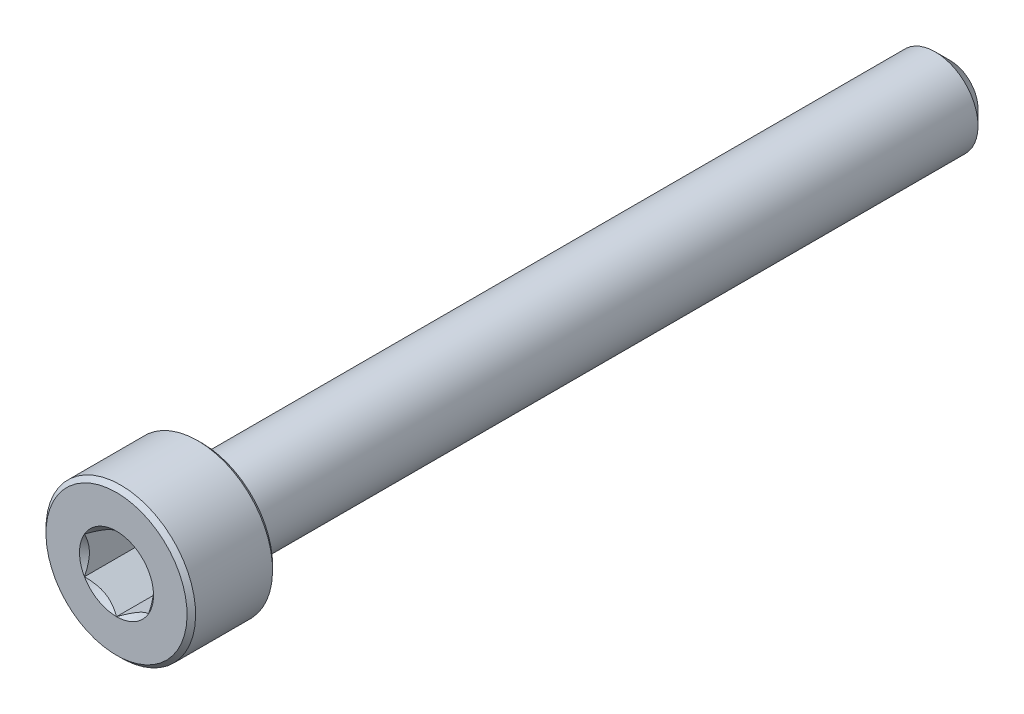
ISO-10303-21;
HEADER;
FILE_DESCRIPTION(('STEP AP214'),'2;1');
FILE_NAME('part.step','',(''),(''),'','','');
FILE_SCHEMA(('AUTOMOTIVE_DESIGN { 1 0 10303 214 1 1 1 1 }'));
ENDSEC;
DATA;
#1=APPLICATION_CONTEXT('core data for automotive mechanical design processes');
#2=APPLICATION_PROTOCOL_DEFINITION('international standard','automotive_design',2000,#1);
#3=PRODUCT_CONTEXT('',#1,'mechanical');
#4=PRODUCT('Part','Part','',(#3));
#5=PRODUCT_RELATED_PRODUCT_CATEGORY('part','',(#4));
#6=PRODUCT_DEFINITION_FORMATION('','',#4);
#7=PRODUCT_DEFINITION_CONTEXT('part definition',#1,'design');
#8=PRODUCT_DEFINITION('design','',#6,#7);
#9=PRODUCT_DEFINITION_SHAPE('','',#8);
#10=(LENGTH_UNIT() NAMED_UNIT(*) SI_UNIT(.MILLI.,.METRE.));
#11=(NAMED_UNIT(*) PLANE_ANGLE_UNIT() SI_UNIT($,.RADIAN.));
#12=(NAMED_UNIT(*) SI_UNIT($,.STERADIAN.) SOLID_ANGLE_UNIT());
#13=UNCERTAINTY_MEASURE_WITH_UNIT(LENGTH_MEASURE(1.E-05),#10,'distance_accuracy_value','');
#14=(GEOMETRIC_REPRESENTATION_CONTEXT(3) GLOBAL_UNCERTAINTY_ASSIGNED_CONTEXT((#13)) GLOBAL_UNIT_ASSIGNED_CONTEXT((#10,
#11,#12)) REPRESENTATION_CONTEXT('',''));
#15=CARTESIAN_POINT('',(0.,0.,0.));
#16=DIRECTION('',(0.,0.,1.));
#17=DIRECTION('',(1.,0.,0.));
#18=AXIS2_PLACEMENT_3D('',#15,#16,#17);
#19=CARTESIAN_POINT('',(0.,0.,19.5));
#20=DIRECTION('',(0.,0.,1.));
#21=DIRECTION('',(0.,-1.,0.));
#22=AXIS2_PLACEMENT_3D('',#19,#20,#21);
#23=PLANE('',#22);
#24=CARTESIAN_POINT('',(0.,0.,19.5));
#25=DIRECTION('',(0.,0.,1.));
#26=DIRECTION('',(1.,0.,0.));
#27=AXIS2_PLACEMENT_3D('',#24,#25,#26);
#28=CIRCLE('',#27,1.73205080756888);
#29=CARTESIAN_POINT('',(0.,-1.73205080756888,19.5));
#30=VERTEX_POINT('',#29);
#31=CARTESIAN_POINT('',(1.5,-0.866025403784438,19.5));
#32=VERTEX_POINT('',#31);
#33=EDGE_CURVE('E99',#30,#32,#28,.T.);
#34=ORIENTED_EDGE('',*,*,#33,.F.);
#35=CARTESIAN_POINT('',(-1.5,-0.866025403784439,19.5));
#36=VERTEX_POINT('',#35);
#37=EDGE_CURVE('E269',#36,#30,#28,.T.);
#38=ORIENTED_EDGE('',*,*,#37,.F.);
#39=CARTESIAN_POINT('',(-1.5,0.86602540378444,19.5));
#40=VERTEX_POINT('',#39);
#41=EDGE_CURVE('E134',#40,#36,#28,.T.);
#42=ORIENTED_EDGE('',*,*,#41,.F.);
#43=CARTESIAN_POINT('',(0.,1.73205080756888,19.5));
#44=VERTEX_POINT('',#43);
#45=EDGE_CURVE('E130',#44,#40,#28,.T.);
#46=ORIENTED_EDGE('',*,*,#45,.F.);
#47=CARTESIAN_POINT('',(1.5,0.86602540378444,19.5));
#48=VERTEX_POINT('',#47);
#49=EDGE_CURVE('E101',#48,#44,#28,.T.);
#50=ORIENTED_EDGE('',*,*,#49,.F.);
#51=EDGE_CURVE('E93',#32,#48,#28,.T.);
#52=ORIENTED_EDGE('',*,*,#51,.F.);
#53=EDGE_LOOP('',(#34,#38,#42,#46,#50,#52));
#54=FACE_BOUND('',#53,.T.);
#55=CARTESIAN_POINT('',(0.,0.,19.5));
#56=DIRECTION('',(0.,0.,-1.));
#57=DIRECTION('',(0.,1.,0.));
#58=AXIS2_PLACEMENT_3D('',#55,#56,#57);
#59=CIRCLE('',#58,3.3);
#60=CARTESIAN_POINT('',(0.,3.3,19.5));
#61=VERTEX_POINT('',#60);
#62=EDGE_CURVE('E49',#61,#61,#59,.T.);
#63=ORIENTED_EDGE('',*,*,#62,.F.);
#64=EDGE_LOOP('',(#63));
#65=FACE_BOUND('',#64,.T.);
#66=ADVANCED_FACE('F36',(#54,#65),#23,.T.);
#67=CARTESIAN_POINT('',(0.,0.,19.3));
#68=DIRECTION('',(0.,0.,-1.));
#69=DIRECTION('',(0.,1.,0.));
#70=AXIS2_PLACEMENT_3D('',#67,#68,#69);
#71=CONICAL_SURFACE('',#70,3.5,0.785398163397434);
#72=ORIENTED_EDGE('',*,*,#62,.T.);
#73=EDGE_LOOP('',(#72));
#74=FACE_BOUND('',#73,.T.);
#75=CARTESIAN_POINT('',(0.,0.,19.3));
#76=DIRECTION('',(0.,0.,-1.));
#77=DIRECTION('',(0.,1.,0.));
#78=AXIS2_PLACEMENT_3D('',#75,#76,#77);
#79=CIRCLE('',#78,3.5);
#80=CARTESIAN_POINT('',(0.,3.5,19.3));
#81=VERTEX_POINT('',#80);
#82=EDGE_CURVE('E220',#81,#81,#79,.T.);
#83=ORIENTED_EDGE('',*,*,#82,.F.);
#84=EDGE_LOOP('',(#83));
#85=FACE_BOUND('',#84,.T.);
#86=ADVANCED_FACE('F208',(#74,#85),#71,.T.);
#87=CARTESIAN_POINT('',(0.,0.,-19.5));
#88=DIRECTION('',(0.,0.,-1.));
#89=DIRECTION('',(0.,1.,0.));
#90=AXIS2_PLACEMENT_3D('',#87,#88,#89);
#91=CYLINDRICAL_SURFACE('',#90,3.5);
#92=ORIENTED_EDGE('',*,*,#82,.T.);
#93=EDGE_LOOP('',(#92));
#94=FACE_BOUND('',#93,.T.);
#95=CARTESIAN_POINT('',(0.,0.,15.7));
#96=DIRECTION('',(0.,0.,-1.));
#97=DIRECTION('',(0.,1.,0.));
#98=AXIS2_PLACEMENT_3D('',#95,#96,#97);
#99=CIRCLE('',#98,3.5);
#100=CARTESIAN_POINT('',(0.,3.5,15.7));
#101=VERTEX_POINT('',#100);
#102=EDGE_CURVE('E221',#101,#101,#99,.T.);
#103=ORIENTED_EDGE('',*,*,#102,.F.);
#104=EDGE_LOOP('',(#103));
#105=FACE_BOUND('',#104,.T.);
#106=ADVANCED_FACE('F205',(#94,#105),#91,.T.);
#107=CARTESIAN_POINT('',(0.,0.,15.5));
#108=DIRECTION('',(0.,0.,1.));
#109=DIRECTION('',(0.,-1.,0.));
#110=AXIS2_PLACEMENT_3D('',#107,#108,#109);
#111=CONICAL_SURFACE('',#110,3.3,0.785398163397452);
#112=ORIENTED_EDGE('',*,*,#102,.T.);
#113=EDGE_LOOP('',(#112));
#114=FACE_BOUND('',#113,.T.);
#115=CARTESIAN_POINT('',(0.,0.,15.5));
#116=DIRECTION('',(0.,0.,-1.));
#117=DIRECTION('',(0.,1.,0.));
#118=AXIS2_PLACEMENT_3D('',#115,#116,#117);
#119=CIRCLE('',#118,3.3);
#120=CARTESIAN_POINT('',(0.,3.3,15.5));
#121=VERTEX_POINT('',#120);
#122=EDGE_CURVE('E224',#121,#121,#119,.T.);
#123=ORIENTED_EDGE('',*,*,#122,.F.);
#124=EDGE_LOOP('',(#123));
#125=FACE_BOUND('',#124,.T.);
#126=ADVANCED_FACE('F201',(#114,#125),#111,.T.);
#127=CARTESIAN_POINT('',(0.,3.3,15.5));
#128=DIRECTION('',(0.,0.,-1.));
#129=DIRECTION('',(0.,1.,0.));
#130=AXIS2_PLACEMENT_3D('',#127,#128,#129);
#131=PLANE('',#130);
#132=ORIENTED_EDGE('',*,*,#122,.T.);
#133=EDGE_LOOP('',(#132));
#134=FACE_BOUND('',#133,.T.);
#135=CARTESIAN_POINT('',(0.,0.,15.5));
#136=DIRECTION('',(0.,0.,-1.));
#137=DIRECTION('',(0.,1.,0.));
#138=AXIS2_PLACEMENT_3D('',#135,#136,#137);
#139=CIRCLE('',#138,2.);
#140=CARTESIAN_POINT('',(0.,2.,15.5));
#141=VERTEX_POINT('',#140);
#142=EDGE_CURVE('E229',#141,#141,#139,.T.);
#143=ORIENTED_EDGE('',*,*,#142,.F.);
#144=EDGE_LOOP('',(#143));
#145=FACE_BOUND('',#144,.T.);
#146=ADVANCED_FACE('F197',(#134,#145),#131,.T.);
#147=CARTESIAN_POINT('',(0.,0.,-19.5));
#148=DIRECTION('',(0.,0.,-1.));
#149=DIRECTION('',(0.,1.,0.));
#150=AXIS2_PLACEMENT_3D('',#147,#148,#149);
#151=CYLINDRICAL_SURFACE('',#150,2.);
#152=ORIENTED_EDGE('',*,*,#142,.T.);
#153=EDGE_LOOP('',(#152));
#154=FACE_BOUND('',#153,.T.);
#155=CARTESIAN_POINT('',(0.,0.,-18.8));
#156=DIRECTION('',(0.,0.,-1.));
#157=DIRECTION('',(0.,1.,0.));
#158=AXIS2_PLACEMENT_3D('',#155,#156,#157);
#159=CIRCLE('',#158,2.);
#160=CARTESIAN_POINT('',(0.,2.,-18.8));
#161=VERTEX_POINT('',#160);
#162=EDGE_CURVE('E232',#161,#161,#159,.T.);
#163=ORIENTED_EDGE('',*,*,#162,.F.);
#164=EDGE_LOOP('',(#163));
#165=FACE_BOUND('',#164,.T.);
#166=ADVANCED_FACE('F193',(#154,#165),#151,.T.);
#167=CARTESIAN_POINT('',(0.,0.,-19.5));
#168=DIRECTION('',(0.,0.,1.));
#169=DIRECTION('',(0.,-1.,0.));
#170=AXIS2_PLACEMENT_3D('',#167,#168,#169);
#171=CONICAL_SURFACE('',#170,1.3,0.785398163397442);
#172=ORIENTED_EDGE('',*,*,#162,.T.);
#173=EDGE_LOOP('',(#172));
#174=FACE_BOUND('',#173,.T.);
#175=CARTESIAN_POINT('',(0.,0.,-19.5));
#176=DIRECTION('',(0.,0.,-1.));
#177=DIRECTION('',(0.,1.,0.));
#178=AXIS2_PLACEMENT_3D('',#175,#176,#177);
#179=CIRCLE('',#178,1.3);
#180=CARTESIAN_POINT('',(0.,1.3,-19.5));
#181=VERTEX_POINT('',#180);
#182=EDGE_CURVE('E235',#181,#181,#179,.T.);
#183=ORIENTED_EDGE('',*,*,#182,.F.);
#184=EDGE_LOOP('',(#183));
#185=FACE_BOUND('',#184,.T.);
#186=ADVANCED_FACE('F189',(#174,#185),#171,.T.);
#187=CARTESIAN_POINT('',(0.,1.3,-19.5));
#188=DIRECTION('',(0.,0.,-1.));
#189=DIRECTION('',(0.,1.,0.));
#190=AXIS2_PLACEMENT_3D('',#187,#188,#189);
#191=PLANE('',#190);
#192=ORIENTED_EDGE('',*,*,#182,.T.);
#193=EDGE_LOOP('',(#192));
#194=FACE_BOUND('',#193,.T.);
#195=ADVANCED_FACE('F186',(#194),#191,.T.);
#196=CARTESIAN_POINT('',(0.,0.,19.5));
#197=DIRECTION('',(0.,0.,1.));
#198=DIRECTION('',(1.,0.,0.));
#199=AXIS2_PLACEMENT_3D('',#196,#197,#198);
#200=CONICAL_SURFACE('',#199,1.73205080756888,0.78539816339745);
#201=ORIENTED_EDGE('',*,*,#33,.T.);
#202=CARTESIAN_POINT('',(-0.000199999999999638,-1.73216627762272,19.5001154816001));
#203=CARTESIAN_POINT('',(0.0513677907370756,-1.70239359975915,19.4703654760673));
#204=CARTESIAN_POINT('',(0.103797917665201,-1.67212305186355,19.4423624839103));
#205=CARTESIAN_POINT('',(0.210709034055597,-1.61039789003619,19.3910892304401));
#206=CARTESIAN_POINT('',(0.265200195814662,-1.57893740312614,19.3678475050444));
#207=CARTESIAN_POINT('',(0.37507908135725,-1.51549879897987,19.3280337289922));
#208=CARTESIAN_POINT('',(0.430438809095201,-1.4835368452681,19.3113615856709));
#209=CARTESIAN_POINT('',(0.542377257477152,-1.41890915196211,19.2856744568181));
#210=CARTESIAN_POINT('',(0.59895255655301,-1.38624538781118,19.2766402904789));
#211=CARTESIAN_POINT('',(0.696455389516442,-1.32995210095299,19.2684890812269));
#212=CARTESIAN_POINT('',(0.737256908280468,-1.30639533311124,19.2672822529892));
#213=CARTESIAN_POINT('',(0.81878796961586,-1.25932335290193,19.2693140571623));
#214=CARTESIAN_POINT('',(0.859517494314631,-1.23580815085313,19.2725536707483));
#215=CARTESIAN_POINT('',(0.940584402163418,-1.18900414978427,19.283291985982));
#216=CARTESIAN_POINT('',(0.98092138459829,-1.16571558211719,19.2907946530187));
#217=CARTESIAN_POINT('',(1.06091833691403,-1.11952932016335,19.3096516119283));
#218=CARTESIAN_POINT('',(1.10057800851621,-1.09663179808786,19.3210075570186));
#219=CARTESIAN_POINT('',(1.20216313477449,-1.03798159809698,19.3547216475927));
#220=CARTESIAN_POINT('',(1.26345855370969,-1.00259267147465,19.3796218490934));
#221=CARTESIAN_POINT('',(1.35358562846331,-0.950557780604374,19.4216566532716));
#222=CARTESIAN_POINT('',(1.38328513990772,-0.933410759677147,19.4364251535591));
#223=CARTESIAN_POINT('',(1.44213790138375,-0.899432101996407,19.4673105659402));
#224=CARTESIAN_POINT('',(1.47129140422064,-0.88260031928571,19.4834268341217));
#225=CARTESIAN_POINT('',(1.5002,-0.865909933730601,19.5001154816001));
#226=B_SPLINE_CURVE_WITH_KNOTS('',3,(#202,#203,#204,#205,#206,#207,#208,#209,#210,#211,#212,
#213,#214,#215,#216,#217,#218,#219,#220,#221,#222,#223,#224,#225),.UNSPECIFIED.,.F.,.F.,(4,2,2,
2,2,2,2,2,2,2,2,4),(0.,0.199829143693305,0.40082298738239,0.598623720538183,0.795926240188891,
0.937113067959883,1.07833105577193,1.21968061668222,1.36109089931055,1.58570969637566,
1.69770705470964,1.80965120737194),.UNSPECIFIED.);
#227=EDGE_CURVE('E12',#30,#32,#226,.T.);
#228=ORIENTED_EDGE('',*,*,#227,.F.);
#229=EDGE_LOOP('',(#201,#228));
#230=FACE_BOUND('',#229,.T.);
#231=ADVANCED_FACE('F152',(#230),#200,.F.);
#232=ORIENTED_EDGE('',*,*,#37,.T.);
#233=CARTESIAN_POINT('',(-1.5002,-0.865909933730601,19.5001154816001));
#234=CARTESIAN_POINT('',(-1.44863220926292,-0.895682611594166,19.4703654760673));
#235=CARTESIAN_POINT('',(-1.3962020823348,-0.925953159489765,19.4423624839103));
#236=CARTESIAN_POINT('',(-1.2892909659444,-0.987678321317124,19.3910892304401));
#237=CARTESIAN_POINT('',(-1.23479980418534,-1.01913880822718,19.3678475050444));
#238=CARTESIAN_POINT('',(-1.12492091864275,-1.08257741237344,19.3280337289922));
#239=CARTESIAN_POINT('',(-1.0695611909048,-1.11453936608522,19.3113615856709));
#240=CARTESIAN_POINT('',(-0.957622742522848,-1.1791670593912,19.2856744568181));
#241=CARTESIAN_POINT('',(-0.90104744344699,-1.21183082354213,19.2766402904789));
#242=CARTESIAN_POINT('',(-0.803544610483557,-1.26812411040032,19.2684890812269));
#243=CARTESIAN_POINT('',(-0.762743091719532,-1.29168087824208,19.2672822529892));
#244=CARTESIAN_POINT('',(-0.681212030384139,-1.33875285845138,19.2693140571623));
#245=CARTESIAN_POINT('',(-0.640482505685368,-1.36226806050018,19.2725536707483));
#246=CARTESIAN_POINT('',(-0.559415597836581,-1.40907206156905,19.283291985982));
#247=CARTESIAN_POINT('',(-0.519078615401708,-1.43236062923612,19.2907946530187));
#248=CARTESIAN_POINT('',(-0.439081663085966,-1.47854689118997,19.3096516119283));
#249=CARTESIAN_POINT('',(-0.399421991483789,-1.50144441326546,19.3210075570186));
#250=CARTESIAN_POINT('',(-0.297836865225513,-1.56009461325633,19.3547216475927));
#251=CARTESIAN_POINT('',(-0.236541446290308,-1.59548353987866,19.3796218490934));
#252=CARTESIAN_POINT('',(-0.146414371536684,-1.64751843074894,19.4216566532716));
#253=CARTESIAN_POINT('',(-0.11671486009228,-1.66466545167617,19.4364251535591));
#254=CARTESIAN_POINT('',(-0.0578620986162474,-1.69864410935691,19.4673105659402));
#255=CARTESIAN_POINT('',(-0.0287085957793616,-1.71547589206761,19.4834268341217));
#256=CARTESIAN_POINT('',(0.000200000000000611,-1.73216627762272,19.5001154816001));
#257=B_SPLINE_CURVE_WITH_KNOTS('',3,(#233,#234,#235,#236,#237,#238,#239,#240,#241,#242,#243,
#244,#245,#246,#247,#248,#249,#250,#251,#252,#253,#254,#255,#256),.UNSPECIFIED.,.F.,.F.,(4,2,2,
2,2,2,2,2,2,2,2,4),(0.,0.199829143693305,0.40082298738239,0.598623720538183,0.795926240188892,
0.937113067959884,1.07833105577193,1.21968061668222,1.36109089931055,1.58570969637566,
1.69770705470964,1.80965120737194),.UNSPECIFIED.);
#258=EDGE_CURVE('E131',#36,#30,#257,.T.);
#259=ORIENTED_EDGE('',*,*,#258,.F.);
#260=EDGE_LOOP('',(#232,#259));
#261=FACE_BOUND('',#260,.T.);
#262=ADVANCED_FACE('F267',(#261),#200,.F.);
#263=ORIENTED_EDGE('',*,*,#41,.T.);
#264=CARTESIAN_POINT('',(-1.5,-1.72720812994822,20.0555785164605));
#265=CARTESIAN_POINT('',(-1.5,-1.68515175723693,20.0238299080399));
#266=CARTESIAN_POINT('',(-1.5,-1.64286104772391,19.9923925939825));
#267=CARTESIAN_POINT('',(-1.5,-1.55771581058238,19.930269087717));
#268=CARTESIAN_POINT('',(-1.5,-1.51486114408249,19.8995830860455));
#269=CARTESIAN_POINT('',(-1.5,-1.38468134170665,19.8084071925586));
#270=CARTESIAN_POINT('',(-1.5,-1.29637976089561,19.7492883435437));
#271=CARTESIAN_POINT('',(-1.5,-1.11121478745132,19.6332309964035));
#272=CARTESIAN_POINT('',(-1.5,-1.01415038251068,19.5766095588047));
#273=CARTESIAN_POINT('',(-1.5,-0.815173408989818,19.4730368813091));
#274=CARTESIAN_POINT('',(-1.5,-0.713278669326363,19.4260530415721));
#275=CARTESIAN_POINT('',(-1.5,-0.560333775001792,19.3685726684515));
#276=CARTESIAN_POINT('',(-1.5,-0.511547983012751,19.3520753877783));
#277=CARTESIAN_POINT('',(-1.5,-0.41279862021383,19.3229975129476));
#278=CARTESIAN_POINT('',(-1.5,-0.362834968520753,19.3104171886138));
#279=CARTESIAN_POINT('',(-1.5,-0.262863235540419,19.2900361941635));
#280=CARTESIAN_POINT('',(-1.5,-0.212872113909477,19.2821536327605));
#281=CARTESIAN_POINT('',(-1.5,-0.112355243682833,19.2713220639777));
#282=CARTESIAN_POINT('',(-1.5,-0.0618295884917323,19.2683722085294));
#283=CARTESIAN_POINT('',(-1.5,0.0374291732025481,19.2676248577218));
#284=CARTESIAN_POINT('',(-1.5,0.0861609670655328,19.2696447335505));
#285=CARTESIAN_POINT('',(-1.5,0.183206937624694,19.2783225528794));
#286=CARTESIAN_POINT('',(-1.5,0.231521073289699,19.2849809469459));
#287=CARTESIAN_POINT('',(-1.5,0.328199853268107,19.302685244089));
#288=CARTESIAN_POINT('',(-1.5,0.37655061614869,19.3138058112177));
#289=CARTESIAN_POINT('',(-1.5,0.472195696955759,19.3398434139978));
#290=CARTESIAN_POINT('',(-1.5,0.519490102919008,19.3547601319841));
#291=CARTESIAN_POINT('',(-1.5,0.668391282485062,19.4073352235115));
#292=CARTESIAN_POINT('',(-1.5,0.76787870926495,19.4509812873618));
#293=CARTESIAN_POINT('',(-1.5,0.962179866385499,19.5480229944291));
#294=CARTESIAN_POINT('',(-1.5,1.05697519927965,19.6014536648971));
#295=CARTESIAN_POINT('',(-1.5,1.23814273494588,19.7116858517578));
#296=CARTESIAN_POINT('',(-1.5,1.32469942140117,19.7681879204262));
#297=CARTESIAN_POINT('',(-1.5,1.45222331245985,19.8555343012678));
#298=CARTESIAN_POINT('',(-1.5,1.49418091932912,19.8849577583565));
#299=CARTESIAN_POINT('',(-1.5,1.5775227288333,19.9445828214816));
#300=CARTESIAN_POINT('',(-1.5,1.6189070859806,19.9747842113029));
#301=CARTESIAN_POINT('',(-1.5,1.66005277969054,20.0053081782352));
#302=B_SPLINE_CURVE_WITH_KNOTS('',3,(#264,#265,#266,#267,#268,#269,#270,#271,#272,#273,#274,
#275,#276,#277,#278,#279,#280,#281,#282,#283,#284,#285,#286,#287,#288,#289,#290,#291,#292,#293,
#294,#295,#296,#297,#298,#299,#300,#301),.UNSPECIFIED.,.F.,.F.,(4,2,2,2,2,2,2,2,2,2,2,2,2,2,2,2,
2,2,4),(0.,0.158079549012754,0.316198781054126,0.634850417468459,0.971690311551775,
1.30737131686505,1.46173961151183,1.61611853763032,1.76772101442094,1.91929742387554,
2.06538741227088,2.21149159321503,2.36014984648184,2.50879566399376,2.83376031423511,
3.15991186974582,3.4698560178094,3.62358896013691,3.77727962610764),.UNSPECIFIED.);
#303=EDGE_CURVE('E132',#40,#36,#302,.F.);
#304=ORIENTED_EDGE('',*,*,#303,.F.);
#305=EDGE_LOOP('',(#263,#304));
#306=FACE_BOUND('',#305,.T.);
#307=ADVANCED_FACE('F272',(#306),#200,.F.);
#308=ORIENTED_EDGE('',*,*,#45,.T.);
#309=CARTESIAN_POINT('',(0.00019999999999983,1.73216627762272,19.5001154816001));
#310=CARTESIAN_POINT('',(-0.0513677907370756,1.70239359975915,19.4703654760673));
#311=CARTESIAN_POINT('',(-0.103797917665201,1.67212305186355,19.4423624839103));
#312=CARTESIAN_POINT('',(-0.210709034055597,1.61039789003619,19.3910892304401));
#313=CARTESIAN_POINT('',(-0.265200195814662,1.57893740312614,19.3678475050444));
#314=CARTESIAN_POINT('',(-0.37507908135725,1.51549879897987,19.3280337289922));
#315=CARTESIAN_POINT('',(-0.430438809095202,1.4835368452681,19.3113615856709));
#316=CARTESIAN_POINT('',(-0.542377257477153,1.41890915196211,19.2856744568181));
#317=CARTESIAN_POINT('',(-0.598952556553012,1.38624538781118,19.2766402904789));
#318=CARTESIAN_POINT('',(-0.696455389516444,1.32995210095299,19.2684890812269));
#319=CARTESIAN_POINT('',(-0.73725690828047,1.30639533311124,19.2672822529892));
#320=CARTESIAN_POINT('',(-0.818787969615862,1.25932335290193,19.2693140571623));
#321=CARTESIAN_POINT('',(-0.859517494314633,1.23580815085313,19.2725536707483));
#322=CARTESIAN_POINT('',(-0.940584402163419,1.18900414978426,19.283291985982));
#323=CARTESIAN_POINT('',(-0.980921384598292,1.16571558211719,19.2907946530187));
#324=CARTESIAN_POINT('',(-1.06091833691403,1.11952932016335,19.3096516119283));
#325=CARTESIAN_POINT('',(-1.10057800851621,1.09663179808786,19.3210075570186));
#326=CARTESIAN_POINT('',(-1.20216313477449,1.03798159809698,19.3547216475927));
#327=CARTESIAN_POINT('',(-1.26345855370969,1.00259267147465,19.3796218490934));
#328=CARTESIAN_POINT('',(-1.35358562846332,0.950557780604373,19.4216566532716));
#329=CARTESIAN_POINT('',(-1.38328513990772,0.933410759677146,19.4364251535591));
#330=CARTESIAN_POINT('',(-1.44213790138375,0.899432101996406,19.4673105659402));
#331=CARTESIAN_POINT('',(-1.47129140422064,0.882600319285709,19.4834268341217));
#332=CARTESIAN_POINT('',(-1.5002,0.865909933730601,19.5001154816001));
#333=B_SPLINE_CURVE_WITH_KNOTS('',3,(#309,#310,#311,#312,#313,#314,#315,#316,#317,#318,#319,
#320,#321,#322,#323,#324,#325,#326,#327,#328,#329,#330,#331,#332),.UNSPECIFIED.,.F.,.F.,(4,2,2,
2,2,2,2,2,2,2,2,4),(0.,0.199829143693306,0.400822987382391,0.598623720538184,0.795926240188893,
0.937113067959886,1.07833105577193,1.21968061668222,1.36109089931055,1.58570969637566,
1.69770705470964,1.80965120737194),.UNSPECIFIED.);
#334=EDGE_CURVE('E111',#44,#40,#333,.T.);
#335=ORIENTED_EDGE('',*,*,#334,.F.);
#336=EDGE_LOOP('',(#308,#335));
#337=FACE_BOUND('',#336,.T.);
#338=ADVANCED_FACE('F306',(#337),#200,.F.);
#339=ORIENTED_EDGE('',*,*,#49,.T.);
#340=CARTESIAN_POINT('',(1.5002,0.865909933730601,19.5001154816001));
#341=CARTESIAN_POINT('',(1.44863220926292,0.895682611594166,19.4703654760673));
#342=CARTESIAN_POINT('',(1.3962020823348,0.925953159489765,19.4423624839103));
#343=CARTESIAN_POINT('',(1.2892909659444,0.987678321317124,19.3910892304401));
#344=CARTESIAN_POINT('',(1.23479980418534,1.01913880822718,19.3678475050444));
#345=CARTESIAN_POINT('',(1.12492091864275,1.08257741237344,19.3280337289922));
#346=CARTESIAN_POINT('',(1.0695611909048,1.11453936608521,19.3113615856709));
#347=CARTESIAN_POINT('',(0.957622742522848,1.1791670593912,19.2856744568181));
#348=CARTESIAN_POINT('',(0.90104744344699,1.21183082354213,19.2766402904789));
#349=CARTESIAN_POINT('',(0.803544610483558,1.26812411040032,19.2684890812269));
#350=CARTESIAN_POINT('',(0.762743091719533,1.29168087824208,19.2672822529892));
#351=CARTESIAN_POINT('',(0.68121203038414,1.33875285845138,19.2693140571623));
#352=CARTESIAN_POINT('',(0.640482505685369,1.36226806050018,19.2725536707483));
#353=CARTESIAN_POINT('',(0.559415597836582,1.40907206156905,19.283291985982));
#354=CARTESIAN_POINT('',(0.51907861540171,1.43236062923612,19.2907946530187));
#355=CARTESIAN_POINT('',(0.439081663085967,1.47854689118997,19.3096516119283));
#356=CARTESIAN_POINT('',(0.39942199148379,1.50144441326545,19.3210075570186));
#357=CARTESIAN_POINT('',(0.297836865225513,1.56009461325633,19.3547216475927));
#358=CARTESIAN_POINT('',(0.236541446290309,1.59548353987866,19.3796218490934));
#359=CARTESIAN_POINT('',(0.146414371536685,1.64751843074894,19.4216566532716));
#360=CARTESIAN_POINT('',(0.116714860092281,1.66466545167617,19.4364251535591));
#361=CARTESIAN_POINT('',(0.0578620986162483,1.69864410935691,19.4673105659402));
#362=CARTESIAN_POINT('',(0.0287085957793622,1.71547589206761,19.4834268341217));
#363=CARTESIAN_POINT('',(-0.000200000000000509,1.73216627762272,19.5001154816001));
#364=B_SPLINE_CURVE_WITH_KNOTS('',3,(#340,#341,#342,#343,#344,#345,#346,#347,#348,#349,#350,
#351,#352,#353,#354,#355,#356,#357,#358,#359,#360,#361,#362,#363),.UNSPECIFIED.,.F.,.F.,(4,2,2,
2,2,2,2,2,2,2,2,4),(0.,0.199829143693305,0.40082298738239,0.598623720538183,0.795926240188891,
0.937113067959883,1.07833105577193,1.21968061668222,1.36109089931055,1.58570969637566,
1.69770705470964,1.80965120737194),.UNSPECIFIED.);
#365=EDGE_CURVE('E104',#48,#44,#364,.T.);
#366=ORIENTED_EDGE('',*,*,#365,.F.);
#367=EDGE_LOOP('',(#339,#366));
#368=FACE_BOUND('',#367,.T.);
#369=ADVANCED_FACE('F105',(#368),#200,.F.);
#370=ORIENTED_EDGE('',*,*,#51,.T.);
#371=CARTESIAN_POINT('',(1.5,-1.72720812969692,20.0555785162708));
#372=CARTESIAN_POINT('',(1.5,-1.68515175699267,20.0238299078574));
#373=CARTESIAN_POINT('',(1.5,-1.64286104748673,19.9923925938074));
#374=CARTESIAN_POINT('',(1.5,-1.55771581035941,19.9302690875564));
#375=CARTESIAN_POINT('',(1.5,-1.51486114386668,19.8995830858922));
#376=CARTESIAN_POINT('',(1.5,-1.3846813415127,19.8084071924272));
#377=CARTESIAN_POINT('',(1.5,-1.29637976071653,19.7492883434268));
#378=CARTESIAN_POINT('',(1.5,-1.11121478730467,19.6332309963165));
#379=CARTESIAN_POINT('',(1.5,-1.01415038238167,19.576609558733));
#380=CARTESIAN_POINT('',(1.5,-0.815173408897604,19.4730368812657));
#381=CARTESIAN_POINT('',(1.5,-0.713278669253284,19.4260530415417));
#382=CARTESIAN_POINT('',(1.5,-0.560333774943111,19.3685726684308));
#383=CARTESIAN_POINT('',(1.5,-0.511547982948041,19.3520753877573));
#384=CARTESIAN_POINT('',(1.5,-0.412798620136866,19.322997512927));
#385=CARTESIAN_POINT('',(1.5,-0.362834968437562,19.310417188594));
#386=CARTESIAN_POINT('',(1.5,-0.262863235444981,19.2900361941468));
#387=CARTESIAN_POINT('',(1.5,-0.212872113808021,19.282153632746));
#388=CARTESIAN_POINT('',(1.5,-0.112355243569543,19.271322063969));
#389=CARTESIAN_POINT('',(1.5,-0.0618295883726256,19.2683722085244));
#390=CARTESIAN_POINT('',(1.5,0.0374291733323861,19.2676248577249));
#391=CARTESIAN_POINT('',(1.5,0.0861609672003006,19.2696447335581));
#392=CARTESIAN_POINT('',(1.5,0.183206937768828,19.2783225528968));
#393=CARTESIAN_POINT('',(1.5,0.23152107343827,19.2849809469685));
#394=CARTESIAN_POINT('',(1.5,0.328199853425437,19.3026852441226));
#395=CARTESIAN_POINT('',(1.5,0.376550616310329,19.313805811257));
#396=CARTESIAN_POINT('',(1.5,0.472195697125599,19.3398434140487));
#397=CARTESIAN_POINT('',(1.5,0.519490103092741,19.3547601320409));
#398=CARTESIAN_POINT('',(1.5,0.668391282696624,19.4073352235961));
#399=CARTESIAN_POINT('',(1.5,0.767878709508552,19.450981287472));
#400=CARTESIAN_POINT('',(1.5,0.962179866690723,19.5480229945931));
#401=CARTESIAN_POINT('',(1.5,1.05697519961444,19.6014536650895));
#402=CARTESIAN_POINT('',(1.5,1.23814273533383,19.7116858520046));
#403=CARTESIAN_POINT('',(1.5,1.3246994218129,19.7681879206986));
#404=CARTESIAN_POINT('',(1.5,1.45222331290673,19.8555343015787));
#405=CARTESIAN_POINT('',(1.5,1.49418091978756,19.88495775868));
#406=CARTESIAN_POINT('',(1.5,1.57752272931476,19.9445828218305));
#407=CARTESIAN_POINT('',(1.5,1.61890708647354,19.9747842116644));
#408=CARTESIAN_POINT('',(1.5,1.66005278019494,20.0053081786095));
#409=B_SPLINE_CURVE_WITH_KNOTS('',3,(#371,#372,#373,#374,#375,#376,#377,#378,#379,#380,#381,
#382,#383,#384,#385,#386,#387,#388,#389,#390,#391,#392,#393,#394,#395,#396,#397,#398,#399,#400,
#401,#402,#403,#404,#405,#406,#407,#408),.UNSPECIFIED.,.F.,.F.,(4,2,2,2,2,2,2,2,2,2,2,2,2,2,2,2,
2,2,4),(0.,0.15807954898267,0.316198780993941,0.634850417346955,0.971690311361506,
1.30737131660666,1.46173961127088,1.61611853740677,1.76772101421409,1.91929742368538,
2.065387412096,2.21149159305544,2.36014984633872,2.50879566386709,2.83376031422673,
3.15991186985651,3.46985601802197,3.62358896039973,3.7772796264207),.UNSPECIFIED.);
#410=EDGE_CURVE('E55',#32,#48,#409,.T.);
#411=ORIENTED_EDGE('',*,*,#410,.F.);
#412=EDGE_LOOP('',(#370,#411));
#413=FACE_BOUND('',#412,.T.);
#414=ADVANCED_FACE('F95',(#413),#200,.F.);
#415=CARTESIAN_POINT('',(0.,3.3,16.5));
#416=DIRECTION('',(0.,0.,-1.));
#417=DIRECTION('',(0.,1.,0.));
#418=AXIS2_PLACEMENT_3D('',#415,#416,#417);
#419=PLANE('',#418);
#420=DIRECTION('',(0.866025403784438,0.5,0.));
#421=VECTOR('',#420,1.);
#422=CARTESIAN_POINT('',(0.,-1.73205080756888,16.5));
#423=LINE('',#422,#421);
#424=CARTESIAN_POINT('',(0.,-1.73205080756888,16.5));
#425=VERTEX_POINT('',#424);
#426=CARTESIAN_POINT('',(1.5,-0.866025403784438,16.5));
#427=VERTEX_POINT('',#426);
#428=EDGE_CURVE('E238',#425,#427,#423,.T.);
#429=ORIENTED_EDGE('',*,*,#428,.T.);
#430=DIRECTION('',(0.,1.,0.));
#431=VECTOR('',#430,1.);
#432=CARTESIAN_POINT('',(1.5,-0.866025403784438,16.5));
#433=LINE('',#432,#431);
#434=CARTESIAN_POINT('',(1.5,0.866025403784439,16.5));
#435=VERTEX_POINT('',#434);
#436=EDGE_CURVE('E121',#427,#435,#433,.T.);
#437=ORIENTED_EDGE('',*,*,#436,.T.);
#438=DIRECTION('',(-0.866025403784439,0.5,0.));
#439=VECTOR('',#438,1.);
#440=CARTESIAN_POINT('',(1.5,0.866025403784439,16.5));
#441=LINE('',#440,#439);
#442=CARTESIAN_POINT('',(0.,1.73205080756888,16.5));
#443=VERTEX_POINT('',#442);
#444=EDGE_CURVE('E125',#435,#443,#441,.T.);
#445=ORIENTED_EDGE('',*,*,#444,.T.);
#446=DIRECTION('',(-0.866025403784438,-0.5,0.));
#447=VECTOR('',#446,1.);
#448=CARTESIAN_POINT('',(0.,1.73205080756888,16.5));
#449=LINE('',#448,#447);
#450=CARTESIAN_POINT('',(-1.5,0.866025403784439,16.5));
#451=VERTEX_POINT('',#450);
#452=EDGE_CURVE('E242',#443,#451,#449,.T.);
#453=ORIENTED_EDGE('',*,*,#452,.T.);
#454=DIRECTION('',(0.,-1.,0.));
#455=VECTOR('',#454,1.);
#456=CARTESIAN_POINT('',(-1.5,0.866025403784438,16.5));
#457=LINE('',#456,#455);
#458=CARTESIAN_POINT('',(-1.5,-0.866025403784439,16.5));
#459=VERTEX_POINT('',#458);
#460=EDGE_CURVE('E246',#451,#459,#457,.T.);
#461=ORIENTED_EDGE('',*,*,#460,.T.);
#462=DIRECTION('',(0.866025403784439,-0.5,0.));
#463=VECTOR('',#462,1.);
#464=CARTESIAN_POINT('',(-1.5,-0.866025403784439,16.5));
#465=LINE('',#464,#463);
#466=EDGE_CURVE('E248',#459,#425,#465,.T.);
#467=ORIENTED_EDGE('',*,*,#466,.T.);
#468=EDGE_LOOP('',(#429,#437,#445,#453,#461,#467));
#469=FACE_BOUND('',#468,.T.);
#470=ADVANCED_FACE('F151',(#469),#419,.F.);
#471=CARTESIAN_POINT('',(0.,-1.73205080756888,10.9174243050442));
#472=DIRECTION('',(0.5,-0.866025403784438,0.));
#473=DIRECTION('',(0.866025403784438,0.5,0.));
#474=AXIS2_PLACEMENT_3D('',#471,#472,#473);
#475=PLANE('',#474);
#476=DIRECTION('',(0.,0.,1.));
#477=VECTOR('',#476,1.);
#478=CARTESIAN_POINT('',(0.,-1.73205080756888,10.9174243050442));
#479=LINE('',#478,#477);
#480=EDGE_CURVE('E249',#425,#30,#479,.T.);
#481=ORIENTED_EDGE('',*,*,#480,.T.);
#482=ORIENTED_EDGE('',*,*,#227,.T.);
#483=DIRECTION('',(0.,0.,1.));
#484=VECTOR('',#483,1.);
#485=CARTESIAN_POINT('',(1.5,-0.866025403784438,10.9174243050442));
#486=LINE('',#485,#484);
#487=EDGE_CURVE('E120',#427,#32,#486,.T.);
#488=ORIENTED_EDGE('',*,*,#487,.F.);
#489=ORIENTED_EDGE('',*,*,#428,.F.);
#490=EDGE_LOOP('',(#481,#482,#488,#489));
#491=FACE_BOUND('',#490,.T.);
#492=ADVANCED_FACE('F153',(#491),#475,.F.);
#493=CARTESIAN_POINT('',(-1.5,-0.866025403784439,10.9174243050442));
#494=DIRECTION('',(-0.5,-0.866025403784439,0.));
#495=DIRECTION('',(0.866025403784439,-0.5,0.));
#496=AXIS2_PLACEMENT_3D('',#493,#494,#495);
#497=PLANE('',#496);
#498=DIRECTION('',(0.,0.,1.));
#499=VECTOR('',#498,1.);
#500=CARTESIAN_POINT('',(-1.5,-0.866025403784439,10.9174243050442));
#501=LINE('',#500,#499);
#502=EDGE_CURVE('E63',#459,#36,#501,.T.);
#503=ORIENTED_EDGE('',*,*,#502,.T.);
#504=ORIENTED_EDGE('',*,*,#258,.T.);
#505=ORIENTED_EDGE('',*,*,#480,.F.);
#506=ORIENTED_EDGE('',*,*,#466,.F.);
#507=EDGE_LOOP('',(#503,#504,#505,#506));
#508=FACE_BOUND('',#507,.T.);
#509=ADVANCED_FACE('F147',(#508),#497,.F.);
#510=CARTESIAN_POINT('',(-1.5,0.866025403784438,10.9174243050442));
#511=DIRECTION('',(-1.,0.,0.));
#512=DIRECTION('',(0.,-1.,0.));
#513=AXIS2_PLACEMENT_3D('',#510,#511,#512);
#514=PLANE('',#513);
#515=DIRECTION('',(0.,0.,1.));
#516=VECTOR('',#515,1.);
#517=CARTESIAN_POINT('',(-1.5,0.866025403784438,10.9174243050442));
#518=LINE('',#517,#516);
#519=EDGE_CURVE('E243',#451,#40,#518,.T.);
#520=ORIENTED_EDGE('',*,*,#519,.T.);
#521=ORIENTED_EDGE('',*,*,#303,.T.);
#522=ORIENTED_EDGE('',*,*,#502,.F.);
#523=ORIENTED_EDGE('',*,*,#460,.F.);
#524=EDGE_LOOP('',(#520,#521,#522,#523));
#525=FACE_BOUND('',#524,.T.);
#526=ADVANCED_FACE('F278',(#525),#514,.F.);
#527=CARTESIAN_POINT('',(0.,1.73205080756888,10.9174243050442));
#528=DIRECTION('',(-0.5,0.866025403784438,0.));
#529=DIRECTION('',(-0.866025403784438,-0.5,0.));
#530=AXIS2_PLACEMENT_3D('',#527,#528,#529);
#531=PLANE('',#530);
#532=DIRECTION('',(0.,0.,1.));
#533=VECTOR('',#532,1.);
#534=CARTESIAN_POINT('',(0.,1.73205080756888,10.9174243050442));
#535=LINE('',#534,#533);
#536=EDGE_CURVE('E240',#443,#44,#535,.T.);
#537=ORIENTED_EDGE('',*,*,#536,.T.);
#538=ORIENTED_EDGE('',*,*,#334,.T.);
#539=ORIENTED_EDGE('',*,*,#519,.F.);
#540=ORIENTED_EDGE('',*,*,#452,.F.);
#541=EDGE_LOOP('',(#537,#538,#539,#540));
#542=FACE_BOUND('',#541,.T.);
#543=ADVANCED_FACE('F178',(#542),#531,.F.);
#544=CARTESIAN_POINT('',(1.5,0.866025403784439,10.9174243050442));
#545=DIRECTION('',(0.5,0.866025403784439,0.));
#546=DIRECTION('',(-0.866025403784439,0.5,0.));
#547=AXIS2_PLACEMENT_3D('',#544,#545,#546);
#548=PLANE('',#547);
#549=DIRECTION('',(0.,0.,1.));
#550=VECTOR('',#549,1.);
#551=CARTESIAN_POINT('',(1.5,0.866025403784439,10.9174243050442));
#552=LINE('',#551,#550);
#553=EDGE_CURVE('E117',#435,#48,#552,.T.);
#554=ORIENTED_EDGE('',*,*,#553,.T.);
#555=ORIENTED_EDGE('',*,*,#365,.T.);
#556=ORIENTED_EDGE('',*,*,#536,.F.);
#557=ORIENTED_EDGE('',*,*,#444,.F.);
#558=EDGE_LOOP('',(#554,#555,#556,#557));
#559=FACE_BOUND('',#558,.T.);
#560=ADVANCED_FACE('F123',(#559),#548,.F.);
#561=CARTESIAN_POINT('',(1.5,-0.866025403784438,10.9174243050442));
#562=DIRECTION('',(1.,0.,0.));
#563=DIRECTION('',(0.,0.,-1.));
#564=AXIS2_PLACEMENT_3D('',#561,#562,#563);
#565=PLANE('',#564);
#566=ORIENTED_EDGE('',*,*,#487,.T.);
#567=ORIENTED_EDGE('',*,*,#410,.T.);
#568=ORIENTED_EDGE('',*,*,#553,.F.);
#569=ORIENTED_EDGE('',*,*,#436,.F.);
#570=EDGE_LOOP('',(#566,#567,#568,#569));
#571=FACE_BOUND('',#570,.T.);
#572=ADVANCED_FACE('F116',(#571),#565,.F.);
#573=CLOSED_SHELL('',(#66,#86,#106,#126,#146,#166,#186,#195,#231,#262,#307,#338,#369,#414,#470,
#492,#509,#526,#543,#560,#572));
#574=MANIFOLD_SOLID_BREP('B2',#573);
#575=ADVANCED_BREP_SHAPE_REPRESENTATION('',(#18,#574),#14);
#576=SHAPE_DEFINITION_REPRESENTATION(#9,#575);
ENDSEC;
END-ISO-10303-21;
